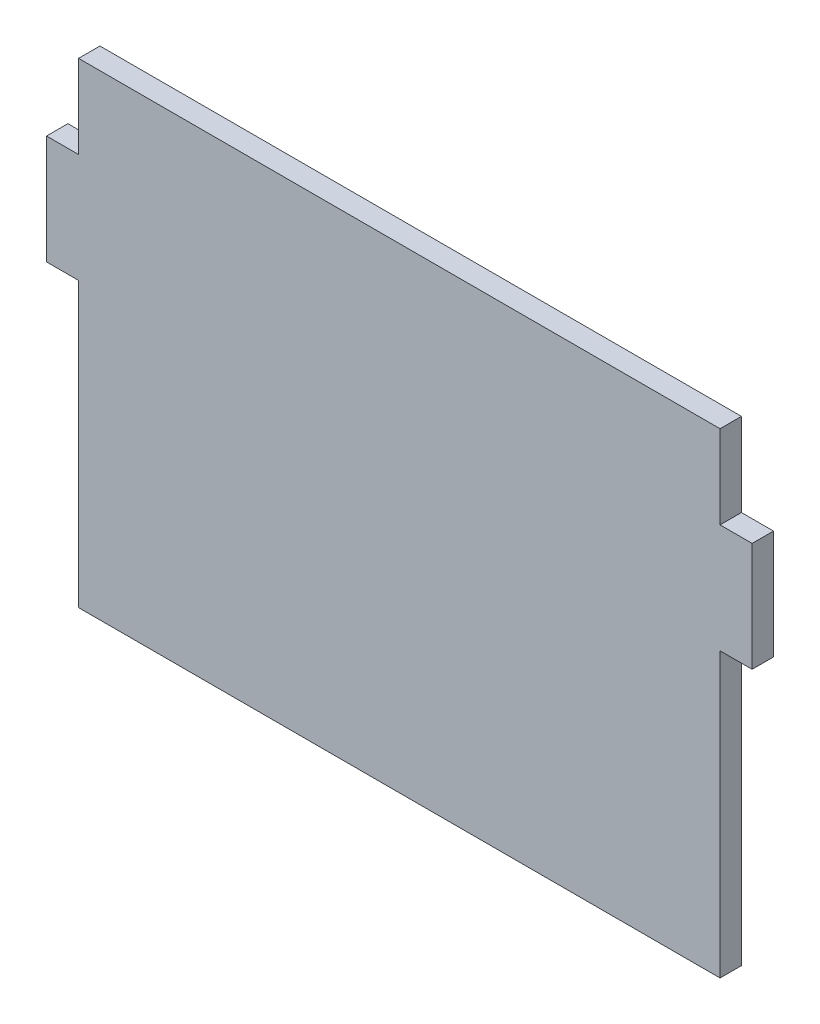
ISO-10303-21;
HEADER;
FILE_DESCRIPTION(('STEP AP214'),'2;1');
FILE_NAME('part.step','',(''),(''),'','','');
FILE_SCHEMA(('AUTOMOTIVE_DESIGN { 1 0 10303 214 1 1 1 1 }'));
ENDSEC;
DATA;
#1=APPLICATION_CONTEXT('core data for automotive mechanical design processes');
#2=APPLICATION_PROTOCOL_DEFINITION('international standard','automotive_design',2000,#1);
#3=PRODUCT_CONTEXT('',#1,'mechanical');
#4=PRODUCT('Part','Part','',(#3));
#5=PRODUCT_RELATED_PRODUCT_CATEGORY('part','',(#4));
#6=PRODUCT_DEFINITION_FORMATION('','',#4);
#7=PRODUCT_DEFINITION_CONTEXT('part definition',#1,'design');
#8=PRODUCT_DEFINITION('design','',#6,#7);
#9=PRODUCT_DEFINITION_SHAPE('','',#8);
#10=(LENGTH_UNIT() NAMED_UNIT(*) SI_UNIT(.MILLI.,.METRE.));
#11=(NAMED_UNIT(*) PLANE_ANGLE_UNIT() SI_UNIT($,.RADIAN.));
#12=(NAMED_UNIT(*) SI_UNIT($,.STERADIAN.) SOLID_ANGLE_UNIT());
#13=UNCERTAINTY_MEASURE_WITH_UNIT(LENGTH_MEASURE(1.E-05),#10,'distance_accuracy_value','');
#14=(GEOMETRIC_REPRESENTATION_CONTEXT(3) GLOBAL_UNCERTAINTY_ASSIGNED_CONTEXT((#13)) GLOBAL_UNIT_ASSIGNED_CONTEXT((#10,
#11,#12)) REPRESENTATION_CONTEXT('',''));
#15=CARTESIAN_POINT('',(0.,0.,0.));
#16=DIRECTION('',(0.,0.,1.));
#17=DIRECTION('',(1.,0.,0.));
#18=AXIS2_PLACEMENT_3D('',#15,#16,#17);
#19=CARTESIAN_POINT('',(150.,111.235,10.));
#20=DIRECTION('',(-1.,0.,0.));
#21=DIRECTION('',(0.,0.,1.));
#22=AXIS2_PLACEMENT_3D('',#19,#20,#21);
#23=PLANE('',#22);
#24=DIRECTION('',(0.,1.,0.));
#25=VECTOR('',#24,1.);
#26=CARTESIAN_POINT('',(150.,111.235,0.));
#27=LINE('',#26,#25);
#28=CARTESIAN_POINT('',(150.,72.285,0.));
#29=VERTEX_POINT('',#28);
#30=CARTESIAN_POINT('',(150.,111.235,0.));
#31=VERTEX_POINT('',#30);
#32=EDGE_CURVE('E154',#29,#31,#27,.T.);
#33=ORIENTED_EDGE('',*,*,#32,.T.);
#34=DIRECTION('',(0.,0.,-1.));
#35=VECTOR('',#34,1.);
#36=CARTESIAN_POINT('',(150.,111.235,10.));
#37=LINE('',#36,#35);
#38=CARTESIAN_POINT('',(150.,111.235,10.));
#39=VERTEX_POINT('',#38);
#40=EDGE_CURVE('E11',#39,#31,#37,.T.);
#41=ORIENTED_EDGE('',*,*,#40,.F.);
#42=DIRECTION('',(0.,1.,0.));
#43=VECTOR('',#42,1.);
#44=CARTESIAN_POINT('',(150.,111.235,10.));
#45=LINE('',#44,#43);
#46=CARTESIAN_POINT('',(150.,72.285,10.));
#47=VERTEX_POINT('',#46);
#48=EDGE_CURVE('E176',#47,#39,#45,.T.);
#49=ORIENTED_EDGE('',*,*,#48,.F.);
#50=DIRECTION('',(0.,0.,-1.));
#51=VECTOR('',#50,1.);
#52=CARTESIAN_POINT('',(150.,72.285,10.));
#53=LINE('',#52,#51);
#54=EDGE_CURVE('E150',#47,#29,#53,.T.);
#55=ORIENTED_EDGE('',*,*,#54,.T.);
#56=EDGE_LOOP('',(#33,#41,#49,#55));
#57=FACE_BOUND('',#56,.T.);
#58=ADVANCED_FACE('F34',(#57),#23,.F.);
#59=CARTESIAN_POINT('',(-150.,111.235,10.));
#60=DIRECTION('',(0.,-1.,0.));
#61=DIRECTION('',(0.,0.,-1.));
#62=AXIS2_PLACEMENT_3D('',#59,#60,#61);
#63=PLANE('',#62);
#64=DIRECTION('',(-1.,0.,0.));
#65=VECTOR('',#64,1.);
#66=CARTESIAN_POINT('',(-150.,111.235,0.));
#67=LINE('',#66,#65);
#68=CARTESIAN_POINT('',(-150.,111.235,0.));
#69=VERTEX_POINT('',#68);
#70=EDGE_CURVE('E157',#31,#69,#67,.T.);
#71=ORIENTED_EDGE('',*,*,#70,.T.);
#72=DIRECTION('',(0.,0.,-1.));
#73=VECTOR('',#72,1.);
#74=CARTESIAN_POINT('',(-150.,111.235,10.));
#75=LINE('',#74,#73);
#76=CARTESIAN_POINT('',(-150.,111.235,10.));
#77=VERTEX_POINT('',#76);
#78=EDGE_CURVE('E42',#77,#69,#75,.T.);
#79=ORIENTED_EDGE('',*,*,#78,.F.);
#80=DIRECTION('',(-1.,0.,0.));
#81=VECTOR('',#80,1.);
#82=CARTESIAN_POINT('',(-150.,111.235,10.));
#83=LINE('',#82,#81);
#84=EDGE_CURVE('E105',#39,#77,#83,.T.);
#85=ORIENTED_EDGE('',*,*,#84,.F.);
#86=ORIENTED_EDGE('',*,*,#40,.T.);
#87=EDGE_LOOP('',(#71,#79,#85,#86));
#88=FACE_BOUND('',#87,.T.);
#89=ADVANCED_FACE('F254',(#88),#63,.F.);
#90=CARTESIAN_POINT('',(-150.,72.285,10.));
#91=DIRECTION('',(1.,0.,0.));
#92=DIRECTION('',(0.,0.,-1.));
#93=AXIS2_PLACEMENT_3D('',#90,#91,#92);
#94=PLANE('',#93);
#95=DIRECTION('',(0.,-1.,0.));
#96=VECTOR('',#95,1.);
#97=CARTESIAN_POINT('',(-150.,72.285,0.));
#98=LINE('',#97,#96);
#99=CARTESIAN_POINT('',(-150.,72.285,0.));
#100=VERTEX_POINT('',#99);
#101=EDGE_CURVE('E159',#69,#100,#98,.T.);
#102=ORIENTED_EDGE('',*,*,#101,.T.);
#103=DIRECTION('',(0.,0.,-1.));
#104=VECTOR('',#103,1.);
#105=CARTESIAN_POINT('',(-150.,72.285,10.));
#106=LINE('',#105,#104);
#107=CARTESIAN_POINT('',(-150.,72.285,10.));
#108=VERTEX_POINT('',#107);
#109=EDGE_CURVE('E195',#108,#100,#106,.T.);
#110=ORIENTED_EDGE('',*,*,#109,.F.);
#111=DIRECTION('',(0.,-1.,0.));
#112=VECTOR('',#111,1.);
#113=CARTESIAN_POINT('',(-150.,72.285,10.));
#114=LINE('',#113,#112);
#115=EDGE_CURVE('E203',#77,#108,#114,.T.);
#116=ORIENTED_EDGE('',*,*,#115,.F.);
#117=ORIENTED_EDGE('',*,*,#78,.T.);
#118=EDGE_LOOP('',(#102,#110,#116,#117));
#119=FACE_BOUND('',#118,.T.);
#120=ADVANCED_FACE('F201',(#119),#94,.F.);
#121=CARTESIAN_POINT('',(-165.,72.285,10.));
#122=DIRECTION('',(0.,-1.,0.));
#123=DIRECTION('',(0.,0.,-1.));
#124=AXIS2_PLACEMENT_3D('',#121,#122,#123);
#125=PLANE('',#124);
#126=DIRECTION('',(-1.,0.,0.));
#127=VECTOR('',#126,1.);
#128=CARTESIAN_POINT('',(-165.,72.285,0.));
#129=LINE('',#128,#127);
#130=CARTESIAN_POINT('',(-165.,72.285,0.));
#131=VERTEX_POINT('',#130);
#132=EDGE_CURVE('E161',#100,#131,#129,.T.);
#133=ORIENTED_EDGE('',*,*,#132,.T.);
#134=DIRECTION('',(0.,0.,-1.));
#135=VECTOR('',#134,1.);
#136=CARTESIAN_POINT('',(-165.,72.285,10.));
#137=LINE('',#136,#135);
#138=CARTESIAN_POINT('',(-165.,72.285,10.));
#139=VERTEX_POINT('',#138);
#140=EDGE_CURVE('E192',#139,#131,#137,.T.);
#141=ORIENTED_EDGE('',*,*,#140,.F.);
#142=DIRECTION('',(-1.,0.,0.));
#143=VECTOR('',#142,1.);
#144=CARTESIAN_POINT('',(-165.,72.285,10.));
#145=LINE('',#144,#143);
#146=EDGE_CURVE('E221',#108,#139,#145,.T.);
#147=ORIENTED_EDGE('',*,*,#146,.F.);
#148=ORIENTED_EDGE('',*,*,#109,.T.);
#149=EDGE_LOOP('',(#133,#141,#147,#148));
#150=FACE_BOUND('',#149,.T.);
#151=ADVANCED_FACE('F212',(#150),#125,.F.);
#152=CARTESIAN_POINT('',(-165.,21.285,10.));
#153=DIRECTION('',(1.,0.,0.));
#154=DIRECTION('',(0.,0.,-1.));
#155=AXIS2_PLACEMENT_3D('',#152,#153,#154);
#156=PLANE('',#155);
#157=DIRECTION('',(0.,-1.,0.));
#158=VECTOR('',#157,1.);
#159=CARTESIAN_POINT('',(-165.,21.285,0.));
#160=LINE('',#159,#158);
#161=CARTESIAN_POINT('',(-165.,21.285,0.));
#162=VERTEX_POINT('',#161);
#163=EDGE_CURVE('E163',#131,#162,#160,.T.);
#164=ORIENTED_EDGE('',*,*,#163,.T.);
#165=DIRECTION('',(0.,0.,-1.));
#166=VECTOR('',#165,1.);
#167=CARTESIAN_POINT('',(-165.,21.285,10.));
#168=LINE('',#167,#166);
#169=CARTESIAN_POINT('',(-165.,21.285,10.));
#170=VERTEX_POINT('',#169);
#171=EDGE_CURVE('E189',#170,#162,#168,.T.);
#172=ORIENTED_EDGE('',*,*,#171,.F.);
#173=DIRECTION('',(0.,-1.,0.));
#174=VECTOR('',#173,1.);
#175=CARTESIAN_POINT('',(-165.,21.285,10.));
#176=LINE('',#175,#174);
#177=EDGE_CURVE('E218',#139,#170,#176,.T.);
#178=ORIENTED_EDGE('',*,*,#177,.F.);
#179=ORIENTED_EDGE('',*,*,#140,.T.);
#180=EDGE_LOOP('',(#164,#172,#178,#179));
#181=FACE_BOUND('',#180,.T.);
#182=ADVANCED_FACE('F216',(#181),#156,.F.);
#183=CARTESIAN_POINT('',(-150.,21.285,10.));
#184=DIRECTION('',(0.,1.,0.));
#185=DIRECTION('',(-1.,0.,0.));
#186=AXIS2_PLACEMENT_3D('',#183,#184,#185);
#187=PLANE('',#186);
#188=DIRECTION('',(1.,0.,0.));
#189=VECTOR('',#188,1.);
#190=CARTESIAN_POINT('',(-150.,21.285,0.));
#191=LINE('',#190,#189);
#192=CARTESIAN_POINT('',(-150.,21.285,0.));
#193=VERTEX_POINT('',#192);
#194=EDGE_CURVE('E165',#162,#193,#191,.T.);
#195=ORIENTED_EDGE('',*,*,#194,.T.);
#196=DIRECTION('',(0.,0.,-1.));
#197=VECTOR('',#196,1.);
#198=CARTESIAN_POINT('',(-150.,21.285,10.));
#199=LINE('',#198,#197);
#200=CARTESIAN_POINT('',(-150.,21.285,10.));
#201=VERTEX_POINT('',#200);
#202=EDGE_CURVE('E186',#201,#193,#199,.T.);
#203=ORIENTED_EDGE('',*,*,#202,.F.);
#204=DIRECTION('',(1.,0.,0.));
#205=VECTOR('',#204,1.);
#206=CARTESIAN_POINT('',(-150.,21.285,10.));
#207=LINE('',#206,#205);
#208=EDGE_CURVE('E220',#170,#201,#207,.T.);
#209=ORIENTED_EDGE('',*,*,#208,.F.);
#210=ORIENTED_EDGE('',*,*,#171,.T.);
#211=EDGE_LOOP('',(#195,#203,#209,#210));
#212=FACE_BOUND('',#211,.T.);
#213=ADVANCED_FACE('F267',(#212),#187,.F.);
#214=CARTESIAN_POINT('',(-150.,-111.235,10.));
#215=DIRECTION('',(1.,0.,0.));
#216=DIRECTION('',(0.,0.,-1.));
#217=AXIS2_PLACEMENT_3D('',#214,#215,#216);
#218=PLANE('',#217);
#219=DIRECTION('',(0.,-1.,0.));
#220=VECTOR('',#219,1.);
#221=CARTESIAN_POINT('',(-150.,-111.235,0.));
#222=LINE('',#221,#220);
#223=CARTESIAN_POINT('',(-150.,-111.235,0.));
#224=VERTEX_POINT('',#223);
#225=EDGE_CURVE('E167',#193,#224,#222,.T.);
#226=ORIENTED_EDGE('',*,*,#225,.T.);
#227=DIRECTION('',(0.,0.,-1.));
#228=VECTOR('',#227,1.);
#229=CARTESIAN_POINT('',(-150.,-111.235,10.));
#230=LINE('',#229,#228);
#231=CARTESIAN_POINT('',(-150.,-111.235,10.));
#232=VERTEX_POINT('',#231);
#233=EDGE_CURVE('E183',#232,#224,#230,.T.);
#234=ORIENTED_EDGE('',*,*,#233,.F.);
#235=DIRECTION('',(0.,-1.,0.));
#236=VECTOR('',#235,1.);
#237=CARTESIAN_POINT('',(-150.,-111.235,10.));
#238=LINE('',#237,#236);
#239=EDGE_CURVE('E223',#201,#232,#238,.T.);
#240=ORIENTED_EDGE('',*,*,#239,.F.);
#241=ORIENTED_EDGE('',*,*,#202,.T.);
#242=EDGE_LOOP('',(#226,#234,#240,#241));
#243=FACE_BOUND('',#242,.T.);
#244=ADVANCED_FACE('F270',(#243),#218,.F.);
#245=CARTESIAN_POINT('',(150.,-111.235,10.));
#246=DIRECTION('',(0.,1.,0.));
#247=DIRECTION('',(0.,0.,1.));
#248=AXIS2_PLACEMENT_3D('',#245,#246,#247);
#249=PLANE('',#248);
#250=DIRECTION('',(1.,0.,0.));
#251=VECTOR('',#250,1.);
#252=CARTESIAN_POINT('',(150.,-111.235,0.));
#253=LINE('',#252,#251);
#254=CARTESIAN_POINT('',(150.,-111.235,0.));
#255=VERTEX_POINT('',#254);
#256=EDGE_CURVE('E169',#224,#255,#253,.T.);
#257=ORIENTED_EDGE('',*,*,#256,.T.);
#258=DIRECTION('',(0.,0.,-1.));
#259=VECTOR('',#258,1.);
#260=CARTESIAN_POINT('',(150.,-111.235,10.));
#261=LINE('',#260,#259);
#262=CARTESIAN_POINT('',(150.,-111.235,10.));
#263=VERTEX_POINT('',#262);
#264=EDGE_CURVE('E180',#263,#255,#261,.T.);
#265=ORIENTED_EDGE('',*,*,#264,.F.);
#266=DIRECTION('',(1.,0.,0.));
#267=VECTOR('',#266,1.);
#268=CARTESIAN_POINT('',(150.,-111.235,10.));
#269=LINE('',#268,#267);
#270=EDGE_CURVE('E229',#232,#263,#269,.T.);
#271=ORIENTED_EDGE('',*,*,#270,.F.);
#272=ORIENTED_EDGE('',*,*,#233,.T.);
#273=EDGE_LOOP('',(#257,#265,#271,#272));
#274=FACE_BOUND('',#273,.T.);
#275=ADVANCED_FACE('F235',(#274),#249,.F.);
#276=CARTESIAN_POINT('',(150.,21.285,10.));
#277=DIRECTION('',(-1.,0.,0.));
#278=DIRECTION('',(0.,0.,1.));
#279=AXIS2_PLACEMENT_3D('',#276,#277,#278);
#280=PLANE('',#279);
#281=DIRECTION('',(0.,1.,0.));
#282=VECTOR('',#281,1.);
#283=CARTESIAN_POINT('',(150.,21.285,0.));
#284=LINE('',#283,#282);
#285=CARTESIAN_POINT('',(150.,21.285,0.));
#286=VERTEX_POINT('',#285);
#287=EDGE_CURVE('E171',#255,#286,#284,.T.);
#288=ORIENTED_EDGE('',*,*,#287,.T.);
#289=DIRECTION('',(0.,0.,-1.));
#290=VECTOR('',#289,1.);
#291=CARTESIAN_POINT('',(150.,21.285,10.));
#292=LINE('',#291,#290);
#293=CARTESIAN_POINT('',(150.,21.285,10.));
#294=VERTEX_POINT('',#293);
#295=EDGE_CURVE('E145',#294,#286,#292,.T.);
#296=ORIENTED_EDGE('',*,*,#295,.F.);
#297=DIRECTION('',(0.,1.,0.));
#298=VECTOR('',#297,1.);
#299=CARTESIAN_POINT('',(150.,21.285,10.));
#300=LINE('',#299,#298);
#301=EDGE_CURVE('E136',#263,#294,#300,.T.);
#302=ORIENTED_EDGE('',*,*,#301,.F.);
#303=ORIENTED_EDGE('',*,*,#264,.T.);
#304=EDGE_LOOP('',(#288,#296,#302,#303));
#305=FACE_BOUND('',#304,.T.);
#306=ADVANCED_FACE('F239',(#305),#280,.F.);
#307=CARTESIAN_POINT('',(165.,21.285,10.));
#308=DIRECTION('',(0.,1.,0.));
#309=DIRECTION('',(-1.,0.,0.));
#310=AXIS2_PLACEMENT_3D('',#307,#308,#309);
#311=PLANE('',#310);
#312=DIRECTION('',(1.,0.,0.));
#313=VECTOR('',#312,1.);
#314=CARTESIAN_POINT('',(165.,21.285,0.));
#315=LINE('',#314,#313);
#316=CARTESIAN_POINT('',(165.,21.285,0.));
#317=VERTEX_POINT('',#316);
#318=EDGE_CURVE('E144',#286,#317,#315,.T.);
#319=ORIENTED_EDGE('',*,*,#318,.T.);
#320=DIRECTION('',(0.,0.,-1.));
#321=VECTOR('',#320,1.);
#322=CARTESIAN_POINT('',(165.,21.285,10.));
#323=LINE('',#322,#321);
#324=CARTESIAN_POINT('',(165.,21.285,10.));
#325=VERTEX_POINT('',#324);
#326=EDGE_CURVE('E141',#325,#317,#323,.T.);
#327=ORIENTED_EDGE('',*,*,#326,.F.);
#328=DIRECTION('',(1.,0.,0.));
#329=VECTOR('',#328,1.);
#330=CARTESIAN_POINT('',(165.,21.285,10.));
#331=LINE('',#330,#329);
#332=EDGE_CURVE('E130',#294,#325,#331,.T.);
#333=ORIENTED_EDGE('',*,*,#332,.F.);
#334=ORIENTED_EDGE('',*,*,#295,.T.);
#335=EDGE_LOOP('',(#319,#327,#333,#334));
#336=FACE_BOUND('',#335,.T.);
#337=ADVANCED_FACE('F142',(#336),#311,.F.);
#338=CARTESIAN_POINT('',(165.,72.285,10.));
#339=DIRECTION('',(-1.,0.,0.));
#340=DIRECTION('',(0.,0.,1.));
#341=AXIS2_PLACEMENT_3D('',#338,#339,#340);
#342=PLANE('',#341);
#343=DIRECTION('',(0.,1.,0.));
#344=VECTOR('',#343,1.);
#345=CARTESIAN_POINT('',(165.,72.285,0.));
#346=LINE('',#345,#344);
#347=CARTESIAN_POINT('',(165.,72.285,0.));
#348=VERTEX_POINT('',#347);
#349=EDGE_CURVE('E91',#317,#348,#346,.T.);
#350=ORIENTED_EDGE('',*,*,#349,.T.);
#351=DIRECTION('',(0.,0.,-1.));
#352=VECTOR('',#351,1.);
#353=CARTESIAN_POINT('',(165.,72.285,10.));
#354=LINE('',#353,#352);
#355=CARTESIAN_POINT('',(165.,72.285,10.));
#356=VERTEX_POINT('',#355);
#357=EDGE_CURVE('E146',#356,#348,#354,.T.);
#358=ORIENTED_EDGE('',*,*,#357,.F.);
#359=DIRECTION('',(0.,1.,0.));
#360=VECTOR('',#359,1.);
#361=CARTESIAN_POINT('',(165.,72.285,10.));
#362=LINE('',#361,#360);
#363=EDGE_CURVE('E134',#325,#356,#362,.T.);
#364=ORIENTED_EDGE('',*,*,#363,.F.);
#365=ORIENTED_EDGE('',*,*,#326,.T.);
#366=EDGE_LOOP('',(#350,#358,#364,#365));
#367=FACE_BOUND('',#366,.T.);
#368=ADVANCED_FACE('F148',(#367),#342,.F.);
#369=CARTESIAN_POINT('',(150.,72.285,10.));
#370=DIRECTION('',(0.,-1.,0.));
#371=DIRECTION('',(0.,0.,-1.));
#372=AXIS2_PLACEMENT_3D('',#369,#370,#371);
#373=PLANE('',#372);
#374=DIRECTION('',(-1.,0.,0.));
#375=VECTOR('',#374,1.);
#376=CARTESIAN_POINT('',(150.,72.285,0.));
#377=LINE('',#376,#375);
#378=EDGE_CURVE('E97',#348,#29,#377,.T.);
#379=ORIENTED_EDGE('',*,*,#378,.T.);
#380=ORIENTED_EDGE('',*,*,#54,.F.);
#381=DIRECTION('',(-1.,0.,0.));
#382=VECTOR('',#381,1.);
#383=CARTESIAN_POINT('',(150.,72.285,10.));
#384=LINE('',#383,#382);
#385=EDGE_CURVE('E50',#356,#47,#384,.T.);
#386=ORIENTED_EDGE('',*,*,#385,.F.);
#387=ORIENTED_EDGE('',*,*,#357,.T.);
#388=EDGE_LOOP('',(#379,#380,#386,#387));
#389=FACE_BOUND('',#388,.T.);
#390=ADVANCED_FACE('F243',(#389),#373,.F.);
#391=CARTESIAN_POINT('',(0.,0.,10.));
#392=DIRECTION('',(0.,0.,1.));
#393=DIRECTION('',(1.,0.,0.));
#394=AXIS2_PLACEMENT_3D('',#391,#392,#393);
#395=PLANE('',#394);
#396=ORIENTED_EDGE('',*,*,#48,.T.);
#397=ORIENTED_EDGE('',*,*,#84,.T.);
#398=ORIENTED_EDGE('',*,*,#115,.T.);
#399=ORIENTED_EDGE('',*,*,#146,.T.);
#400=ORIENTED_EDGE('',*,*,#177,.T.);
#401=ORIENTED_EDGE('',*,*,#208,.T.);
#402=ORIENTED_EDGE('',*,*,#239,.T.);
#403=ORIENTED_EDGE('',*,*,#270,.T.);
#404=ORIENTED_EDGE('',*,*,#301,.T.);
#405=ORIENTED_EDGE('',*,*,#332,.T.);
#406=ORIENTED_EDGE('',*,*,#363,.T.);
#407=ORIENTED_EDGE('',*,*,#385,.T.);
#408=EDGE_LOOP('',(#396,#397,#398,#399,#400,#401,#402,#403,#404,#405,#406,#407));
#409=FACE_BOUND('',#408,.T.);
#410=ADVANCED_FACE('F132',(#409),#395,.T.);
#411=CARTESIAN_POINT('',(0.,0.,0.));
#412=DIRECTION('',(0.,0.,1.));
#413=DIRECTION('',(1.,0.,0.));
#414=AXIS2_PLACEMENT_3D('',#411,#412,#413);
#415=PLANE('',#414);
#416=ORIENTED_EDGE('',*,*,#32,.F.);
#417=ORIENTED_EDGE('',*,*,#378,.F.);
#418=ORIENTED_EDGE('',*,*,#349,.F.);
#419=ORIENTED_EDGE('',*,*,#318,.F.);
#420=ORIENTED_EDGE('',*,*,#287,.F.);
#421=ORIENTED_EDGE('',*,*,#256,.F.);
#422=ORIENTED_EDGE('',*,*,#225,.F.);
#423=ORIENTED_EDGE('',*,*,#194,.F.);
#424=ORIENTED_EDGE('',*,*,#163,.F.);
#425=ORIENTED_EDGE('',*,*,#132,.F.);
#426=ORIENTED_EDGE('',*,*,#101,.F.);
#427=ORIENTED_EDGE('',*,*,#70,.F.);
#428=EDGE_LOOP('',(#416,#417,#418,#419,#420,#421,#422,#423,#424,#425,#426,#427));
#429=FACE_BOUND('',#428,.T.);
#430=ADVANCED_FACE('F207',(#429),#415,.F.);
#431=CLOSED_SHELL('',(#58,#89,#120,#151,#182,#213,#244,#275,#306,#337,#368,#390,#410,#430));
#432=MANIFOLD_SOLID_BREP('B2',#431);
#433=ADVANCED_BREP_SHAPE_REPRESENTATION('',(#18,#432),#14);
#434=SHAPE_DEFINITION_REPRESENTATION(#9,#433);
ENDSEC;
END-ISO-10303-21;
